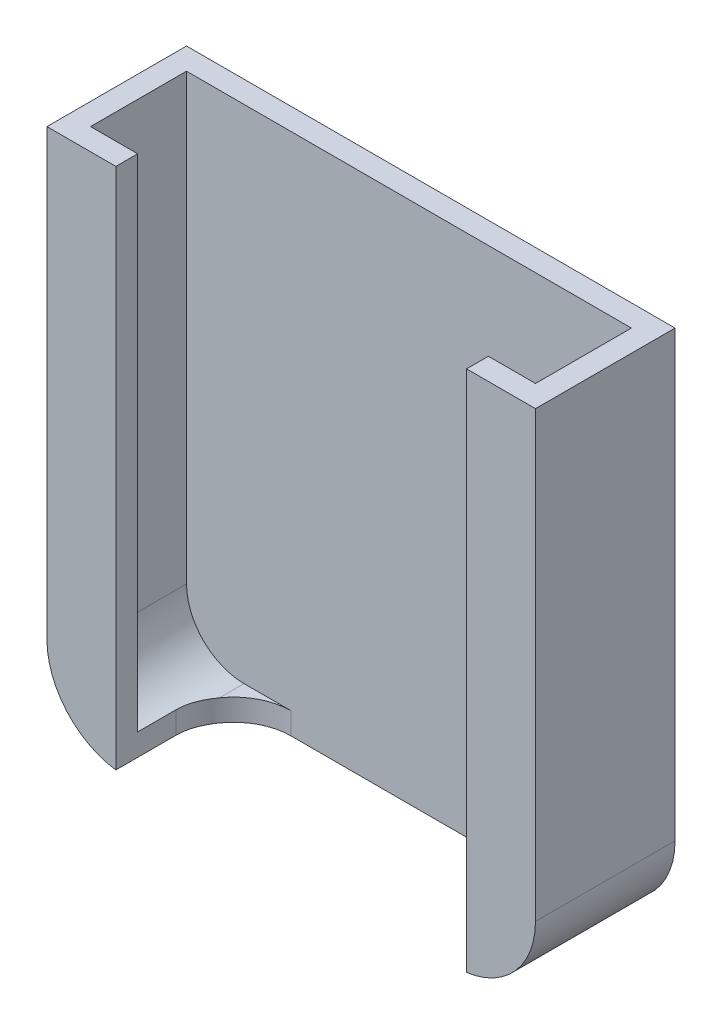
ISO-10303-21;
HEADER;
FILE_DESCRIPTION(('STEP AP214'),'2;1');
FILE_NAME('part.step','',(''),(''),'','','');
FILE_SCHEMA(('AUTOMOTIVE_DESIGN { 1 0 10303 214 1 1 1 1 }'));
ENDSEC;
DATA;
#1=APPLICATION_CONTEXT('core data for automotive mechanical design processes');
#2=APPLICATION_PROTOCOL_DEFINITION('international standard','automotive_design',2000,#1);
#3=PRODUCT_CONTEXT('',#1,'mechanical');
#4=PRODUCT('Part','Part','',(#3));
#5=PRODUCT_RELATED_PRODUCT_CATEGORY('part','',(#4));
#6=PRODUCT_DEFINITION_FORMATION('','',#4);
#7=PRODUCT_DEFINITION_CONTEXT('part definition',#1,'design');
#8=PRODUCT_DEFINITION('design','',#6,#7);
#9=PRODUCT_DEFINITION_SHAPE('','',#8);
#10=(LENGTH_UNIT() NAMED_UNIT(*) SI_UNIT(.MILLI.,.METRE.));
#11=(NAMED_UNIT(*) PLANE_ANGLE_UNIT() SI_UNIT($,.RADIAN.));
#12=(NAMED_UNIT(*) SI_UNIT($,.STERADIAN.) SOLID_ANGLE_UNIT());
#13=UNCERTAINTY_MEASURE_WITH_UNIT(LENGTH_MEASURE(1.E-05),#10,'distance_accuracy_value','');
#14=(GEOMETRIC_REPRESENTATION_CONTEXT(3) GLOBAL_UNCERTAINTY_ASSIGNED_CONTEXT((#13)) GLOBAL_UNIT_ASSIGNED_CONTEXT((#10,
#11,#12)) REPRESENTATION_CONTEXT('',''));
#15=CARTESIAN_POINT('',(0.,0.,0.));
#16=DIRECTION('',(0.,0.,1.));
#17=DIRECTION('',(1.,0.,0.));
#18=AXIS2_PLACEMENT_3D('',#15,#16,#17);
#19=CARTESIAN_POINT('',(0.,0.,10.16));
#20=DIRECTION('',(0.,1.,0.));
#21=DIRECTION('',(0.,0.,1.));
#22=AXIS2_PLACEMENT_3D('',#19,#20,#21);
#23=PLANE('',#22);
#24=DIRECTION('',(0.,0.,1.));
#25=VECTOR('',#24,1.);
#26=CARTESIAN_POINT('',(59.563,0.,-10.16));
#27=LINE('',#26,#25);
#28=CARTESIAN_POINT('',(59.563,0.,-10.16));
#29=VERTEX_POINT('',#28);
#30=CARTESIAN_POINT('',(59.563,0.,-3.42231115409661));
#31=VERTEX_POINT('',#30);
#32=EDGE_CURVE('E175',#29,#31,#27,.T.);
#33=ORIENTED_EDGE('',*,*,#32,.T.);
#34=CARTESIAN_POINT('',(52.705,0.,1.397));
#35=DIRECTION('',(0.,1.,0.));
#36=DIRECTION('',(0.,0.,1.));
#37=AXIS2_PLACEMENT_3D('',#34,#35,#36);
#38=CIRCLE('',#37,8.382);
#39=CARTESIAN_POINT('',(52.705,0.,-6.98500000000001));
#40=VERTEX_POINT('',#39);
#41=EDGE_CURVE('E231',#31,#40,#38,.T.);
#42=ORIENTED_EDGE('',*,*,#41,.T.);
#43=DIRECTION('',(-1.,0.,0.));
#44=VECTOR('',#43,1.);
#45=CARTESIAN_POINT('',(10.033,0.,-6.985));
#46=LINE('',#45,#44);
#47=CARTESIAN_POINT('',(18.415,0.,-6.985));
#48=VERTEX_POINT('',#47);
#49=EDGE_CURVE('E394',#40,#48,#46,.T.);
#50=ORIENTED_EDGE('',*,*,#49,.T.);
#51=CARTESIAN_POINT('',(18.415,0.,1.397));
#52=DIRECTION('',(0.,1.,0.));
#53=DIRECTION('',(0.,0.,1.));
#54=AXIS2_PLACEMENT_3D('',#51,#52,#53);
#55=CIRCLE('',#54,8.382);
#56=CARTESIAN_POINT('',(11.557,0.,-3.4223111540966));
#57=VERTEX_POINT('',#56);
#58=EDGE_CURVE('E226',#48,#57,#55,.T.);
#59=ORIENTED_EDGE('',*,*,#58,.T.);
#60=DIRECTION('',(0.,0.,1.));
#61=VECTOR('',#60,1.);
#62=CARTESIAN_POINT('',(11.557,0.,-10.16));
#63=LINE('',#62,#61);
#64=CARTESIAN_POINT('',(11.557,0.,-10.16));
#65=VERTEX_POINT('',#64);
#66=EDGE_CURVE('E63',#65,#57,#63,.T.);
#67=ORIENTED_EDGE('',*,*,#66,.F.);
#68=DIRECTION('',(1.,0.,0.));
#69=VECTOR('',#68,1.);
#70=CARTESIAN_POINT('',(0.,0.,-10.16));
#71=LINE('',#70,#69);
#72=EDGE_CURVE('E190',#65,#29,#71,.T.);
#73=ORIENTED_EDGE('',*,*,#72,.T.);
#74=EDGE_LOOP('',(#33,#42,#50,#59,#67,#73));
#75=FACE_BOUND('',#74,.T.);
#76=ADVANCED_FACE('F35',(#75),#23,.F.);
#77=CARTESIAN_POINT('',(0.,0.,10.16));
#78=DIRECTION('',(1.,0.,0.));
#79=DIRECTION('',(0.,1.,0.));
#80=AXIS2_PLACEMENT_3D('',#77,#78,#79);
#81=PLANE('',#80);
#82=DIRECTION('',(0.,0.,1.));
#83=VECTOR('',#82,1.);
#84=CARTESIAN_POINT('',(0.,11.557,-10.16));
#85=LINE('',#84,#83);
#86=CARTESIAN_POINT('',(0.,11.557,-10.16));
#87=VERTEX_POINT('',#86);
#88=CARTESIAN_POINT('',(0.,11.557,10.16));
#89=VERTEX_POINT('',#88);
#90=EDGE_CURVE('E405',#87,#89,#85,.T.);
#91=ORIENTED_EDGE('',*,*,#90,.T.);
#92=DIRECTION('',(0.,-1.,0.));
#93=VECTOR('',#92,1.);
#94=CARTESIAN_POINT('',(0.,0.,10.16));
#95=LINE('',#94,#93);
#96=CARTESIAN_POINT('',(0.,76.2,10.16));
#97=VERTEX_POINT('',#96);
#98=EDGE_CURVE('E206',#97,#89,#95,.T.);
#99=ORIENTED_EDGE('',*,*,#98,.F.);
#100=DIRECTION('',(0.,0.,-1.));
#101=VECTOR('',#100,1.);
#102=CARTESIAN_POINT('',(0.,76.2,10.16));
#103=LINE('',#102,#101);
#104=CARTESIAN_POINT('',(0.,76.2,-10.16));
#105=VERTEX_POINT('',#104);
#106=EDGE_CURVE('E207',#97,#105,#103,.T.);
#107=ORIENTED_EDGE('',*,*,#106,.T.);
#108=DIRECTION('',(0.,-1.,0.));
#109=VECTOR('',#108,1.);
#110=CARTESIAN_POINT('',(0.,0.,-10.16));
#111=LINE('',#110,#109);
#112=EDGE_CURVE('E196',#105,#87,#111,.T.);
#113=ORIENTED_EDGE('',*,*,#112,.T.);
#114=EDGE_LOOP('',(#91,#99,#107,#113));
#115=FACE_BOUND('',#114,.T.);
#116=ADVANCED_FACE('F281',(#115),#81,.F.);
#117=CARTESIAN_POINT('',(0.,0.,10.16));
#118=DIRECTION('',(0.,0.,-1.));
#119=DIRECTION('',(-1.,0.,0.));
#120=AXIS2_PLACEMENT_3D('',#117,#118,#119);
#121=PLANE('',#120);
#122=ORIENTED_EDGE('',*,*,#98,.T.);
#123=CARTESIAN_POINT('',(11.557,11.557,10.16));
#124=DIRECTION('',(0.,0.,-1.));
#125=DIRECTION('',(1.,0.,0.));
#126=AXIS2_PLACEMENT_3D('',#123,#124,#125);
#127=CIRCLE('',#126,11.557);
#128=CARTESIAN_POINT('',(10.033,0.10092418844918,10.16));
#129=VERTEX_POINT('',#128);
#130=EDGE_CURVE('E410',#129,#89,#127,.T.);
#131=ORIENTED_EDGE('',*,*,#130,.F.);
#132=DIRECTION('',(0.,1.,0.));
#133=VECTOR('',#132,1.);
#134=CARTESIAN_POINT('',(10.033,0.,10.16));
#135=LINE('',#134,#133);
#136=CARTESIAN_POINT('',(10.033,76.2,10.16));
#137=VERTEX_POINT('',#136);
#138=EDGE_CURVE('E392',#129,#137,#135,.T.);
#139=ORIENTED_EDGE('',*,*,#138,.T.);
#140=DIRECTION('',(-1.,0.,0.));
#141=VECTOR('',#140,1.);
#142=CARTESIAN_POINT('',(0.,76.2,10.16));
#143=LINE('',#142,#141);
#144=EDGE_CURVE('E350',#137,#97,#143,.T.);
#145=ORIENTED_EDGE('',*,*,#144,.T.);
#146=EDGE_LOOP('',(#122,#131,#139,#145));
#147=FACE_BOUND('',#146,.T.);
#148=ADVANCED_FACE('F286',(#147),#121,.F.);
#149=CARTESIAN_POINT('',(3.17499999999997,-66.2594431005876,6.985));
#150=DIRECTION('',(0.,0.,1.));
#151=DIRECTION('',(1.,0.,0.));
#152=AXIS2_PLACEMENT_3D('',#149,#150,#151);
#153=PLANE('',#152);
#154=DIRECTION('',(0.,-1.,0.));
#155=VECTOR('',#154,1.);
#156=CARTESIAN_POINT('',(10.033,-66.2594431005876,6.985));
#157=LINE('',#156,#155);
#158=CARTESIAN_POINT('',(10.033,76.2,6.985));
#159=VERTEX_POINT('',#158);
#160=CARTESIAN_POINT('',(10.033,3.31470978428932,6.985));
#161=VERTEX_POINT('',#160);
#162=EDGE_CURVE('E384',#159,#161,#157,.T.);
#163=ORIENTED_EDGE('',*,*,#162,.T.);
#164=CARTESIAN_POINT('',(11.557,11.557,6.985));
#165=DIRECTION('',(0.,0.,1.));
#166=DIRECTION('',(1.,0.,0.));
#167=AXIS2_PLACEMENT_3D('',#164,#165,#166);
#168=CIRCLE('',#167,8.382);
#169=CARTESIAN_POINT('',(3.17499999999997,11.557,6.985));
#170=VERTEX_POINT('',#169);
#171=EDGE_CURVE('E249',#161,#170,#168,.F.);
#172=ORIENTED_EDGE('',*,*,#171,.T.);
#173=DIRECTION('',(0.,1.,0.));
#174=VECTOR('',#173,1.);
#175=CARTESIAN_POINT('',(3.17499999999997,-66.2594431005876,6.985));
#176=LINE('',#175,#174);
#177=CARTESIAN_POINT('',(3.17499999999997,76.2,6.985));
#178=VERTEX_POINT('',#177);
#179=EDGE_CURVE('E363',#170,#178,#176,.T.);
#180=ORIENTED_EDGE('',*,*,#179,.T.);
#181=DIRECTION('',(1.,0.,0.));
#182=VECTOR('',#181,1.);
#183=CARTESIAN_POINT('',(3.17499999999997,76.2,6.985));
#184=LINE('',#183,#182);
#185=EDGE_CURVE('E378',#178,#159,#184,.T.);
#186=ORIENTED_EDGE('',*,*,#185,.T.);
#187=EDGE_LOOP('',(#163,#172,#180,#186));
#188=FACE_BOUND('',#187,.T.);
#189=ADVANCED_FACE('F331',(#188),#153,.F.);
#190=CARTESIAN_POINT('',(0.,3.175,10.16));
#191=DIRECTION('',(0.,1.,0.));
#192=DIRECTION('',(0.,0.,1.));
#193=AXIS2_PLACEMENT_3D('',#190,#191,#192);
#194=PLANE('',#193);
#195=DIRECTION('',(1.,0.,0.));
#196=VECTOR('',#195,1.);
#197=CARTESIAN_POINT('',(3.17499999999997,3.175,-6.985));
#198=LINE('',#197,#196);
#199=CARTESIAN_POINT('',(11.557,3.175,-6.985));
#200=VERTEX_POINT('',#199);
#201=CARTESIAN_POINT('',(18.415,3.175,-6.985));
#202=VERTEX_POINT('',#201);
#203=EDGE_CURVE('E201',#200,#202,#198,.T.);
#204=ORIENTED_EDGE('',*,*,#203,.F.);
#205=DIRECTION('',(0.,0.,-1.));
#206=VECTOR('',#205,1.);
#207=CARTESIAN_POINT('',(11.557,3.175,10.16));
#208=LINE('',#207,#206);
#209=CARTESIAN_POINT('',(11.557,3.175,-3.4223111540966));
#210=VERTEX_POINT('',#209);
#211=EDGE_CURVE('E247',#200,#210,#208,.F.);
#212=ORIENTED_EDGE('',*,*,#211,.T.);
#213=CARTESIAN_POINT('',(18.415,3.175,1.397));
#214=DIRECTION('',(0.,1.,0.));
#215=DIRECTION('',(0.,0.,1.));
#216=AXIS2_PLACEMENT_3D('',#213,#214,#215);
#217=CIRCLE('',#216,8.382);
#218=EDGE_CURVE('E224',#210,#202,#217,.F.);
#219=ORIENTED_EDGE('',*,*,#218,.T.);
#220=EDGE_LOOP('',(#204,#212,#219));
#221=FACE_BOUND('',#220,.T.);
#222=ADVANCED_FACE('F318',(#221),#194,.T.);
#223=CARTESIAN_POINT('',(71.12,0.,10.16));
#224=DIRECTION('',(-1.,0.,0.));
#225=DIRECTION('',(0.,-1.,0.));
#226=AXIS2_PLACEMENT_3D('',#223,#224,#225);
#227=PLANE('',#226);
#228=DIRECTION('',(0.,1.,0.));
#229=VECTOR('',#228,1.);
#230=CARTESIAN_POINT('',(71.12,0.,10.16));
#231=LINE('',#230,#229);
#232=CARTESIAN_POINT('',(71.12,11.557,10.16));
#233=VERTEX_POINT('',#232);
#234=CARTESIAN_POINT('',(71.12,76.2,10.16));
#235=VERTEX_POINT('',#234);
#236=EDGE_CURVE('E358',#233,#235,#231,.T.);
#237=ORIENTED_EDGE('',*,*,#236,.F.);
#238=DIRECTION('',(0.,0.,1.));
#239=VECTOR('',#238,1.);
#240=CARTESIAN_POINT('',(71.12,11.557,-10.16));
#241=LINE('',#240,#239);
#242=CARTESIAN_POINT('',(71.12,11.557,-10.16));
#243=VERTEX_POINT('',#242);
#244=EDGE_CURVE('E183',#243,#233,#241,.T.);
#245=ORIENTED_EDGE('',*,*,#244,.F.);
#246=DIRECTION('',(0.,1.,0.));
#247=VECTOR('',#246,1.);
#248=CARTESIAN_POINT('',(71.12,0.,-10.16));
#249=LINE('',#248,#247);
#250=CARTESIAN_POINT('',(71.12,76.2,-10.16));
#251=VERTEX_POINT('',#250);
#252=EDGE_CURVE('E192',#243,#251,#249,.T.);
#253=ORIENTED_EDGE('',*,*,#252,.T.);
#254=DIRECTION('',(0.,0.,-1.));
#255=VECTOR('',#254,1.);
#256=CARTESIAN_POINT('',(71.12,76.2,10.16));
#257=LINE('',#256,#255);
#258=EDGE_CURVE('E210',#235,#251,#257,.T.);
#259=ORIENTED_EDGE('',*,*,#258,.F.);
#260=EDGE_LOOP('',(#237,#245,#253,#259));
#261=FACE_BOUND('',#260,.T.);
#262=ADVANCED_FACE('F290',(#261),#227,.F.);
#263=CARTESIAN_POINT('',(0.,76.2,10.16));
#264=DIRECTION('',(0.,-1.,0.));
#265=DIRECTION('',(0.,0.,-1.));
#266=AXIS2_PLACEMENT_3D('',#263,#264,#265);
#267=PLANE('',#266);
#268=ORIENTED_EDGE('',*,*,#144,.F.);
#269=DIRECTION('',(0.,0.,1.));
#270=VECTOR('',#269,1.);
#271=CARTESIAN_POINT('',(10.033,76.2,10.16));
#272=LINE('',#271,#270);
#273=EDGE_CURVE('E353',#159,#137,#272,.T.);
#274=ORIENTED_EDGE('',*,*,#273,.F.);
#275=ORIENTED_EDGE('',*,*,#185,.F.);
#276=DIRECTION('',(0.,0.,1.));
#277=VECTOR('',#276,1.);
#278=CARTESIAN_POINT('',(3.17499999999997,76.2,6.985));
#279=LINE('',#278,#277);
#280=CARTESIAN_POINT('',(3.17499999999997,76.2,-6.985));
#281=VERTEX_POINT('',#280);
#282=EDGE_CURVE('E381',#281,#178,#279,.T.);
#283=ORIENTED_EDGE('',*,*,#282,.F.);
#284=DIRECTION('',(-1.,0.,0.));
#285=VECTOR('',#284,1.);
#286=CARTESIAN_POINT('',(3.17499999999997,76.2,-6.985));
#287=LINE('',#286,#285);
#288=CARTESIAN_POINT('',(67.945,76.2,-6.985));
#289=VERTEX_POINT('',#288);
#290=EDGE_CURVE('E366',#289,#281,#287,.T.);
#291=ORIENTED_EDGE('',*,*,#290,.F.);
#292=DIRECTION('',(0.,0.,-1.));
#293=VECTOR('',#292,1.);
#294=CARTESIAN_POINT('',(67.945,76.2,-6.985));
#295=LINE('',#294,#293);
#296=CARTESIAN_POINT('',(67.945,76.2,6.985));
#297=VERTEX_POINT('',#296);
#298=EDGE_CURVE('E375',#297,#289,#295,.T.);
#299=ORIENTED_EDGE('',*,*,#298,.F.);
#300=CARTESIAN_POINT('',(61.087,76.2,6.985));
#301=VERTEX_POINT('',#300);
#302=EDGE_CURVE('E380',#301,#297,#184,.T.);
#303=ORIENTED_EDGE('',*,*,#302,.F.);
#304=DIRECTION('',(0.,0.,-1.));
#305=VECTOR('',#304,1.);
#306=CARTESIAN_POINT('',(61.087,76.2,10.16));
#307=LINE('',#306,#305);
#308=CARTESIAN_POINT('',(61.087,76.2,10.16));
#309=VERTEX_POINT('',#308);
#310=EDGE_CURVE('E396',#309,#301,#307,.T.);
#311=ORIENTED_EDGE('',*,*,#310,.F.);
#312=EDGE_CURVE('E211',#235,#309,#143,.T.);
#313=ORIENTED_EDGE('',*,*,#312,.F.);
#314=ORIENTED_EDGE('',*,*,#258,.T.);
#315=DIRECTION('',(-1.,0.,0.));
#316=VECTOR('',#315,1.);
#317=CARTESIAN_POINT('',(0.,76.2,-10.16));
#318=LINE('',#317,#316);
#319=EDGE_CURVE('E198',#251,#105,#318,.T.);
#320=ORIENTED_EDGE('',*,*,#319,.T.);
#321=ORIENTED_EDGE('',*,*,#106,.F.);
#322=EDGE_LOOP('',(#268,#274,#275,#283,#291,#299,#303,#311,#313,#314,#320,#321));
#323=FACE_BOUND('',#322,.T.);
#324=ADVANCED_FACE('F338',(#323),#267,.F.);
#325=DIRECTION('',(0.,1.,0.));
#326=VECTOR('',#325,1.);
#327=CARTESIAN_POINT('',(61.087,0.,10.16));
#328=LINE('',#327,#326);
#329=CARTESIAN_POINT('',(61.087,0.100924188449163,10.16));
#330=VERTEX_POINT('',#329);
#331=EDGE_CURVE('E391',#330,#309,#328,.T.);
#332=ORIENTED_EDGE('',*,*,#331,.F.);
#333=CARTESIAN_POINT('',(59.563,11.557,10.16));
#334=DIRECTION('',(0.,0.,-1.));
#335=DIRECTION('',(1.,0.,0.));
#336=AXIS2_PLACEMENT_3D('',#333,#334,#335);
#337=CIRCLE('',#336,11.557);
#338=EDGE_CURVE('E193',#233,#330,#337,.T.);
#339=ORIENTED_EDGE('',*,*,#338,.F.);
#340=ORIENTED_EDGE('',*,*,#236,.T.);
#341=ORIENTED_EDGE('',*,*,#312,.T.);
#342=EDGE_LOOP('',(#332,#339,#340,#341));
#343=FACE_BOUND('',#342,.T.);
#344=ADVANCED_FACE('F335',(#343),#121,.F.);
#345=CARTESIAN_POINT('',(0.,0.,-10.16));
#346=DIRECTION('',(0.,0.,-1.));
#347=DIRECTION('',(-1.,0.,0.));
#348=AXIS2_PLACEMENT_3D('',#345,#346,#347);
#349=PLANE('',#348);
#350=CARTESIAN_POINT('',(59.563,11.557,-10.16));
#351=DIRECTION('',(0.,0.,-1.));
#352=DIRECTION('',(1.,0.,0.));
#353=AXIS2_PLACEMENT_3D('',#350,#351,#352);
#354=CIRCLE('',#353,11.557);
#355=EDGE_CURVE('E178',#243,#29,#354,.T.);
#356=ORIENTED_EDGE('',*,*,#355,.T.);
#357=ORIENTED_EDGE('',*,*,#72,.F.);
#358=CARTESIAN_POINT('',(11.557,11.557,-10.16));
#359=DIRECTION('',(0.,0.,-1.));
#360=DIRECTION('',(1.,0.,0.));
#361=AXIS2_PLACEMENT_3D('',#358,#359,#360);
#362=CIRCLE('',#361,11.557);
#363=EDGE_CURVE('E408',#65,#87,#362,.T.);
#364=ORIENTED_EDGE('',*,*,#363,.T.);
#365=ORIENTED_EDGE('',*,*,#112,.F.);
#366=ORIENTED_EDGE('',*,*,#319,.F.);
#367=ORIENTED_EDGE('',*,*,#252,.F.);
#368=EDGE_LOOP('',(#356,#357,#364,#365,#366,#367));
#369=FACE_BOUND('',#368,.T.);
#370=ADVANCED_FACE('F188',(#369),#349,.T.);
#371=CARTESIAN_POINT('',(3.17499999999997,-66.2594431005876,6.985));
#372=DIRECTION('',(-1.,0.,0.));
#373=DIRECTION('',(0.,0.,1.));
#374=AXIS2_PLACEMENT_3D('',#371,#372,#373);
#375=PLANE('',#374);
#376=ORIENTED_EDGE('',*,*,#179,.F.);
#377=DIRECTION('',(0.,0.,-1.));
#378=VECTOR('',#377,1.);
#379=CARTESIAN_POINT('',(3.17499999999997,11.557,6.985));
#380=LINE('',#379,#378);
#381=CARTESIAN_POINT('',(3.17499999999997,11.557,-6.985));
#382=VERTEX_POINT('',#381);
#383=EDGE_CURVE('E244',#170,#382,#380,.T.);
#384=ORIENTED_EDGE('',*,*,#383,.T.);
#385=DIRECTION('',(0.,1.,0.));
#386=VECTOR('',#385,1.);
#387=CARTESIAN_POINT('',(3.17499999999997,-66.2594431005876,-6.985));
#388=LINE('',#387,#386);
#389=EDGE_CURVE('E370',#382,#281,#388,.T.);
#390=ORIENTED_EDGE('',*,*,#389,.T.);
#391=ORIENTED_EDGE('',*,*,#282,.T.);
#392=EDGE_LOOP('',(#376,#384,#390,#391));
#393=FACE_BOUND('',#392,.T.);
#394=ADVANCED_FACE('F323',(#393),#375,.F.);
#395=CARTESIAN_POINT('',(3.17499999999997,-66.2594431005876,-6.985));
#396=DIRECTION('',(0.,0.,-1.));
#397=DIRECTION('',(-1.,0.,0.));
#398=AXIS2_PLACEMENT_3D('',#395,#396,#397);
#399=PLANE('',#398);
#400=CARTESIAN_POINT('',(52.705,3.175,-6.985));
#401=VERTEX_POINT('',#400);
#402=CARTESIAN_POINT('',(59.563,3.175,-6.985));
#403=VERTEX_POINT('',#402);
#404=EDGE_CURVE('E372',#401,#403,#198,.T.);
#405=ORIENTED_EDGE('',*,*,#404,.T.);
#406=CARTESIAN_POINT('',(59.563,11.557,-6.985));
#407=DIRECTION('',(0.,0.,-1.));
#408=DIRECTION('',(-1.,0.,0.));
#409=AXIS2_PLACEMENT_3D('',#406,#407,#408);
#410=CIRCLE('',#409,8.382);
#411=CARTESIAN_POINT('',(67.945,11.557,-6.985));
#412=VERTEX_POINT('',#411);
#413=EDGE_CURVE('E242',#403,#412,#410,.F.);
#414=ORIENTED_EDGE('',*,*,#413,.T.);
#415=DIRECTION('',(0.,1.,0.));
#416=VECTOR('',#415,1.);
#417=CARTESIAN_POINT('',(67.945,-66.2594431005876,-6.985));
#418=LINE('',#417,#416);
#419=EDGE_CURVE('E368',#412,#289,#418,.T.);
#420=ORIENTED_EDGE('',*,*,#419,.T.);
#421=ORIENTED_EDGE('',*,*,#290,.T.);
#422=ORIENTED_EDGE('',*,*,#389,.F.);
#423=CARTESIAN_POINT('',(11.557,11.557,-6.985));
#424=DIRECTION('',(0.,0.,-1.));
#425=DIRECTION('',(-1.,0.,0.));
#426=AXIS2_PLACEMENT_3D('',#423,#424,#425);
#427=CIRCLE('',#426,8.382);
#428=EDGE_CURVE('E240',#382,#200,#427,.F.);
#429=ORIENTED_EDGE('',*,*,#428,.T.);
#430=ORIENTED_EDGE('',*,*,#203,.T.);
#431=DIRECTION('',(0.,1.,0.));
#432=VECTOR('',#431,1.);
#433=CARTESIAN_POINT('',(18.415,0.,-6.985));
#434=LINE('',#433,#432);
#435=EDGE_CURVE('E219',#202,#48,#434,.F.);
#436=ORIENTED_EDGE('',*,*,#435,.T.);
#437=ORIENTED_EDGE('',*,*,#49,.F.);
#438=DIRECTION('',(0.,1.,0.));
#439=VECTOR('',#438,1.);
#440=CARTESIAN_POINT('',(52.705,3.175,-6.985));
#441=LINE('',#440,#439);
#442=EDGE_CURVE('E216',#40,#401,#441,.T.);
#443=ORIENTED_EDGE('',*,*,#442,.T.);
#444=EDGE_LOOP('',(#405,#414,#420,#421,#422,#429,#430,#436,#437,#443));
#445=FACE_BOUND('',#444,.T.);
#446=ADVANCED_FACE('F319',(#445),#399,.F.);
#447=CARTESIAN_POINT('',(67.945,-66.2594431005876,-6.985));
#448=DIRECTION('',(1.,0.,0.));
#449=DIRECTION('',(0.,0.,-1.));
#450=AXIS2_PLACEMENT_3D('',#447,#448,#449);
#451=PLANE('',#450);
#452=ORIENTED_EDGE('',*,*,#419,.F.);
#453=DIRECTION('',(0.,0.,1.));
#454=VECTOR('',#453,1.);
#455=CARTESIAN_POINT('',(67.945,11.557,-6.985));
#456=LINE('',#455,#454);
#457=CARTESIAN_POINT('',(67.945,11.557,6.985));
#458=VERTEX_POINT('',#457);
#459=EDGE_CURVE('E233',#412,#458,#456,.T.);
#460=ORIENTED_EDGE('',*,*,#459,.T.);
#461=DIRECTION('',(0.,1.,0.));
#462=VECTOR('',#461,1.);
#463=CARTESIAN_POINT('',(67.945,-66.2594431005876,6.985));
#464=LINE('',#463,#462);
#465=EDGE_CURVE('E365',#458,#297,#464,.T.);
#466=ORIENTED_EDGE('',*,*,#465,.T.);
#467=ORIENTED_EDGE('',*,*,#298,.T.);
#468=EDGE_LOOP('',(#452,#460,#466,#467));
#469=FACE_BOUND('',#468,.T.);
#470=ADVANCED_FACE('F322',(#469),#451,.F.);
#471=ORIENTED_EDGE('',*,*,#465,.F.);
#472=CARTESIAN_POINT('',(59.563,11.557,6.985));
#473=DIRECTION('',(0.,0.,1.));
#474=DIRECTION('',(1.,0.,0.));
#475=AXIS2_PLACEMENT_3D('',#472,#473,#474);
#476=CIRCLE('',#475,8.382);
#477=CARTESIAN_POINT('',(61.087,3.31470978428932,6.985));
#478=VERTEX_POINT('',#477);
#479=EDGE_CURVE('E236',#458,#478,#476,.F.);
#480=ORIENTED_EDGE('',*,*,#479,.T.);
#481=DIRECTION('',(0.,1.,0.));
#482=VECTOR('',#481,1.);
#483=CARTESIAN_POINT('',(61.087,-66.2594431005876,6.985));
#484=LINE('',#483,#482);
#485=EDGE_CURVE('E389',#478,#301,#484,.T.);
#486=ORIENTED_EDGE('',*,*,#485,.T.);
#487=ORIENTED_EDGE('',*,*,#302,.T.);
#488=EDGE_LOOP('',(#471,#480,#486,#487));
#489=FACE_BOUND('',#488,.T.);
#490=ADVANCED_FACE('F316',(#489),#153,.F.);
#491=CARTESIAN_POINT('',(52.705,3.175,1.397));
#492=DIRECTION('',(0.,1.,0.));
#493=DIRECTION('',(0.,0.,1.));
#494=AXIS2_PLACEMENT_3D('',#491,#492,#493);
#495=CIRCLE('',#494,8.382);
#496=CARTESIAN_POINT('',(59.563,3.175,-3.42231115409661));
#497=VERTEX_POINT('',#496);
#498=EDGE_CURVE('E228',#401,#497,#495,.F.);
#499=ORIENTED_EDGE('',*,*,#498,.T.);
#500=DIRECTION('',(0.,0.,1.));
#501=VECTOR('',#500,1.);
#502=CARTESIAN_POINT('',(59.563,3.175,10.16));
#503=LINE('',#502,#501);
#504=EDGE_CURVE('E238',#497,#403,#503,.F.);
#505=ORIENTED_EDGE('',*,*,#504,.T.);
#506=ORIENTED_EDGE('',*,*,#404,.F.);
#507=EDGE_LOOP('',(#499,#505,#506));
#508=FACE_BOUND('',#507,.T.);
#509=ADVANCED_FACE('F312',(#508),#194,.T.);
#510=CARTESIAN_POINT('',(10.033,0.,10.16));
#511=DIRECTION('',(-1.,0.,0.));
#512=DIRECTION('',(0.,0.,1.));
#513=AXIS2_PLACEMENT_3D('',#510,#511,#512);
#514=PLANE('',#513);
#515=ORIENTED_EDGE('',*,*,#138,.F.);
#516=DIRECTION('',(0.,0.,1.));
#517=VECTOR('',#516,1.);
#518=CARTESIAN_POINT('',(10.033,0.100924188449182,-10.16));
#519=LINE('',#518,#517);
#520=CARTESIAN_POINT('',(10.033,0.10092418844918,1.397));
#521=VERTEX_POINT('',#520);
#522=EDGE_CURVE('E400',#129,#521,#519,.F.);
#523=ORIENTED_EDGE('',*,*,#522,.T.);
#524=DIRECTION('',(0.,1.,0.));
#525=VECTOR('',#524,1.);
#526=CARTESIAN_POINT('',(10.033,3.175,1.397));
#527=LINE('',#526,#525);
#528=CARTESIAN_POINT('',(10.033,3.31470978428932,1.397));
#529=VERTEX_POINT('',#528);
#530=EDGE_CURVE('E214',#521,#529,#527,.T.);
#531=ORIENTED_EDGE('',*,*,#530,.T.);
#532=DIRECTION('',(0.,0.,-1.));
#533=VECTOR('',#532,1.);
#534=CARTESIAN_POINT('',(10.033,3.31470978428932,1.397));
#535=LINE('',#534,#533);
#536=EDGE_CURVE('E301',#529,#161,#535,.F.);
#537=ORIENTED_EDGE('',*,*,#536,.T.);
#538=ORIENTED_EDGE('',*,*,#162,.F.);
#539=ORIENTED_EDGE('',*,*,#273,.T.);
#540=EDGE_LOOP('',(#515,#523,#531,#537,#538,#539));
#541=FACE_BOUND('',#540,.T.);
#542=ADVANCED_FACE('F308',(#541),#514,.F.);
#543=CARTESIAN_POINT('',(61.087,0.,10.16));
#544=DIRECTION('',(1.,0.,0.));
#545=DIRECTION('',(0.,0.,-1.));
#546=AXIS2_PLACEMENT_3D('',#543,#544,#545);
#547=PLANE('',#546);
#548=DIRECTION('',(0.,1.,0.));
#549=VECTOR('',#548,1.);
#550=CARTESIAN_POINT('',(61.087,0.,1.397));
#551=LINE('',#550,#549);
#552=CARTESIAN_POINT('',(61.087,3.31470978428932,1.397));
#553=VERTEX_POINT('',#552);
#554=CARTESIAN_POINT('',(61.087,0.100924188449163,1.397));
#555=VERTEX_POINT('',#554);
#556=EDGE_CURVE('E221',#553,#555,#551,.F.);
#557=ORIENTED_EDGE('',*,*,#556,.T.);
#558=DIRECTION('',(0.,0.,1.));
#559=VECTOR('',#558,1.);
#560=CARTESIAN_POINT('',(61.087,0.100924188449165,-10.16));
#561=LINE('',#560,#559);
#562=EDGE_CURVE('E56',#555,#330,#561,.T.);
#563=ORIENTED_EDGE('',*,*,#562,.T.);
#564=ORIENTED_EDGE('',*,*,#331,.T.);
#565=ORIENTED_EDGE('',*,*,#310,.T.);
#566=ORIENTED_EDGE('',*,*,#485,.F.);
#567=DIRECTION('',(0.,0.,1.));
#568=VECTOR('',#567,1.);
#569=CARTESIAN_POINT('',(61.087,3.31470978428932,6.985));
#570=LINE('',#569,#568);
#571=EDGE_CURVE('E251',#478,#553,#570,.F.);
#572=ORIENTED_EDGE('',*,*,#571,.T.);
#573=EDGE_LOOP('',(#557,#563,#564,#565,#566,#572));
#574=FACE_BOUND('',#573,.T.);
#575=ADVANCED_FACE('F294',(#574),#547,.F.);
#576=CARTESIAN_POINT('',(18.415,0.,1.397));
#577=DIRECTION('',(0.,-1.,0.));
#578=DIRECTION('',(0.,0.,-1.));
#579=AXIS2_PLACEMENT_3D('',#576,#577,#578);
#580=CYLINDRICAL_SURFACE('',#579,8.382);
#581=ORIENTED_EDGE('',*,*,#530,.F.);
#582=CARTESIAN_POINT('',(10.033,0.10092418844918,1.397));
#583=CARTESIAN_POINT('',(10.0330001216002,0.100926891769128,1.27781716958431));
#584=CARTESIAN_POINT('',(10.0355424176954,0.100585614265902,1.15864982102148));
#585=CARTESIAN_POINT('',(10.0457042230159,0.0992396665317981,0.920537679390941));
#586=CARTESIAN_POINT('',(10.0533236410662,0.0982350082139283,0.80159288236512));
#587=CARTESIAN_POINT('',(10.0837819447924,0.0942634557610099,0.445432522595272));
#588=CARTESIAN_POINT('',(10.1142208878112,0.0903389608833738,0.208831330691911));
#589=CARTESIAN_POINT('',(10.1941123595587,0.0805742377931407,-0.254947171099258));
#590=CARTESIAN_POINT('',(10.2430691985292,0.0747844920747429,-0.482212045978354));
#591=CARTESIAN_POINT('',(10.3596714428242,0.0620404757614991,-0.931845666758199));
#592=CARTESIAN_POINT('',(10.4273140081907,0.0550863821937644,-1.15421515114619));
#593=CARTESIAN_POINT('',(10.5670345353444,0.0423050103386449,-1.55320004000974));
#594=CARTESIAN_POINT('',(10.6361384129774,0.0364994583879133,-1.73086531631127));
#595=CARTESIAN_POINT('',(10.7862971998082,0.0254809787598834,-2.08109075787499));
#596=CARTESIAN_POINT('',(10.8673516375383,0.020268027717945,-2.25365112421128));
#597=CARTESIAN_POINT('',(11.0428817355593,0.0110989808812452,-2.59644956344424));
#598=CARTESIAN_POINT('',(11.1376041347307,0.00717167205607876,-2.76656215831424));
#599=CARTESIAN_POINT('',(11.3386902087527,0.00162702019785621,-3.09985526550659));
#600=CARTESIAN_POINT('',(11.4450567156999,1.02404848771378E-05,-3.26303407792789));
#601=CARTESIAN_POINT('',(11.557,0.,-3.4223111540966));
#602=B_SPLINE_CURVE_WITH_KNOTS('',3,(#582,#583,#584,#585,#586,#587,#588,#589,#590,#591,#592,
#593,#594,#595,#596,#597,#598,#599,#600,#601),.UNSPECIFIED.,.F.,.F.,(4,2,2,2,2,2,2,2,2,4),(0.,
0.357490042474049,0.714973665308341,1.42976252578464,2.12663552232626,2.82340266254982,
3.39513722266547,3.96684923302036,4.55060364014651,5.13450034563536),.UNSPECIFIED.);
#603=EDGE_CURVE('E49',#521,#57,#602,.T.);
#604=ORIENTED_EDGE('',*,*,#603,.T.);
#605=ORIENTED_EDGE('',*,*,#58,.F.);
#606=ORIENTED_EDGE('',*,*,#435,.F.);
#607=ORIENTED_EDGE('',*,*,#218,.F.);
#608=CARTESIAN_POINT('',(11.557,3.175,-3.4223111540966));
#609=CARTESIAN_POINT('',(11.4201706380643,3.17503475193489,-3.22764680998369));
#610=CARTESIAN_POINT('',(11.2917028457249,3.17835195050124,-3.02716753462913));
#611=CARTESIAN_POINT('',(11.0523166747494,3.1893402171039,-2.61613449760462));
#612=CARTESIAN_POINT('',(10.94139583245,3.19701067323013,-2.4055821556505));
#613=CARTESIAN_POINT('',(10.7404455942976,3.21427618772132,-1.98129671003755));
#614=CARTESIAN_POINT('',(10.6499616014961,3.22381809059751,-1.76777618591542));
#615=CARTESIAN_POINT('',(10.4869983719878,3.24316990289561,-1.3340011786149));
#616=CARTESIAN_POINT('',(10.4145168103213,3.25297977752797,-1.11374756912473));
#617=CARTESIAN_POINT('',(10.2991419187214,3.26975179948074,-0.707107658176294));
#618=CARTESIAN_POINT('',(10.2532881630663,3.27691155604305,-0.521562991350999));
#619=CARTESIAN_POINT('',(10.1743578475587,3.28972616933864,-0.147741732242475));
#620=CARTESIAN_POINT('',(10.1412795830204,3.29538122681869,0.0405344920769149));
#621=CARTESIAN_POINT('',(10.0875018732331,3.30476967121521,0.422960293094251));
#622=CARTESIAN_POINT('',(10.0670789956505,3.30845989159719,0.617149877225599));
#623=CARTESIAN_POINT('',(10.0398198567832,3.31344992420793,1.00655783476446));
#624=CARTESIAN_POINT('',(10.0329869249475,3.31474915065279,1.20177644853493));
#625=CARTESIAN_POINT('',(10.033,3.31470978428932,1.397));
#626=B_SPLINE_CURVE_WITH_KNOTS('',3,(#608,#609,#610,#611,#612,#613,#614,#615,#616,#617,#618,
#619,#620,#621,#622,#623,#624,#625),.UNSPECIFIED.,.F.,.F.,(4,2,2,2,2,2,2,2,4),(0.,
0.713520967732658,1.42694166513299,2.12245071277513,2.81786989076243,3.39121929980478,
3.96449217804505,4.54988807116165,5.13542736483504),.UNSPECIFIED.);
#627=EDGE_CURVE('E259',#210,#529,#626,.T.);
#628=ORIENTED_EDGE('',*,*,#627,.T.);
#629=EDGE_LOOP('',(#581,#604,#605,#606,#607,#628));
#630=FACE_BOUND('',#629,.T.);
#631=ADVANCED_FACE('F277',(#630),#580,.F.);
#632=CARTESIAN_POINT('',(52.705,-66.2594431005876,1.397));
#633=DIRECTION('',(0.,-1.,0.));
#634=DIRECTION('',(0.,0.,-1.));
#635=AXIS2_PLACEMENT_3D('',#632,#633,#634);
#636=CYLINDRICAL_SURFACE('',#635,8.382);
#637=ORIENTED_EDGE('',*,*,#41,.F.);
#638=CARTESIAN_POINT('',(59.563,0.,-3.42231115409661));
#639=CARTESIAN_POINT('',(59.7000223702688,2.47684491130002E-05,-3.22737237744299));
#640=CARTESIAN_POINT('',(59.8286730377486,0.00243838190259442,-3.02658276691352));
#641=CARTESIAN_POINT('',(60.0684017285889,0.0104265877248981,-2.61484020560105));
#642=CARTESIAN_POINT('',(60.1794804942256,0.0160010465269709,-2.40388768461329));
#643=CARTESIAN_POINT('',(60.380690006115,0.028535168517937,-1.97874547450376));
#644=CARTESIAN_POINT('',(60.4712766536532,0.0354565417167773,-1.76477001852518));
#645=CARTESIAN_POINT('',(60.634369257799,0.0494749127185589,-1.33006649045538));
#646=CARTESIAN_POINT('',(60.7068780408488,0.0565718828762568,-1.10933948002388));
#647=CARTESIAN_POINT('',(60.8220273923833,0.0686661808126888,-0.702558789218959));
#648=CARTESIAN_POINT('',(60.8676899830859,0.0738120772353291,-0.517358119157079));
#649=CARTESIAN_POINT('',(60.9462844523628,0.0830149818996997,-0.144263203005644));
#650=CARTESIAN_POINT('',(60.9792178290924,0.087072118265024,0.0436307234019774));
#651=CARTESIAN_POINT('',(61.0327542381561,0.0938041658661406,0.425238078171038));
#652=CARTESIAN_POINT('',(61.0530824299556,0.0964481049683222,0.618990644538696));
#653=CARTESIAN_POINT('',(61.0802128407898,0.100022117312855,1.00749434014216));
#654=CARTESIAN_POINT('',(61.0870123724981,0.10095185004341,1.2022456600687));
#655=CARTESIAN_POINT('',(61.087,0.100924188449163,1.397));
#656=B_SPLINE_CURVE_WITH_KNOTS('',3,(#638,#639,#640,#641,#642,#643,#644,#645,#646,#647,#648,
#649,#650,#651,#652,#653,#654,#655),.UNSPECIFIED.,.F.,.F.,(4,2,2,2,2,2,2,2,4),(0.,
0.714569659375951,1.42910912567878,2.12570961959884,2.82220113286937,3.39422163502125,
3.96617479314039,4.5501964963599,5.13433419778497),.UNSPECIFIED.);
#657=EDGE_CURVE('E12',#31,#555,#656,.T.);
#658=ORIENTED_EDGE('',*,*,#657,.T.);
#659=ORIENTED_EDGE('',*,*,#556,.F.);
#660=CARTESIAN_POINT('',(61.087,3.31470978428932,1.397));
#661=CARTESIAN_POINT('',(61.086999951074,3.31471360552115,1.27795622423954));
#662=CARTESIAN_POINT('',(61.084463506646,3.3142402901934,1.15892812664425));
#663=CARTESIAN_POINT('',(61.0743256214428,3.31237404363014,0.921097964431036));
#664=CARTESIAN_POINT('',(61.0667243061785,3.31098113518281,0.802295894285155));
#665=CARTESIAN_POINT('',(61.0363413231231,3.30547619290463,0.446591087139193));
#666=CARTESIAN_POINT('',(61.0059806065798,3.30003789821157,0.21030998239803));
#667=CARTESIAN_POINT('',(60.9263057510118,3.28651659984915,-0.25281902135462));
#668=CARTESIAN_POINT('',(60.8774850165142,3.27850319739935,-0.479755005596635));
#669=CARTESIAN_POINT('',(60.7612184118657,3.26087712330699,-0.928730097119809));
#670=CARTESIAN_POINT('',(60.6937747953313,3.25126464522978,-1.15076979340836));
#671=CARTESIAN_POINT('',(60.5542732117693,3.2335802089725,-1.54973722737956));
#672=CARTESIAN_POINT('',(60.4851419246255,3.22553653197032,-1.72769702652051));
#673=CARTESIAN_POINT('',(60.334884011057,3.21027495334213,-2.07851483839741));
#674=CARTESIAN_POINT('',(60.2537578900026,3.20305701694848,-2.25137306570655));
#675=CARTESIAN_POINT('',(60.0780236415889,3.19036312265616,-2.59479365316573));
#676=CARTESIAN_POINT('',(59.9831670847643,3.1849271497292,-2.76523053859602));
#677=CARTESIAN_POINT('',(59.7817453537058,3.17725244593583,-3.09918646021181));
#678=CARTESIAN_POINT('',(59.6751763381828,3.17501476739148,-3.26270320232581));
#679=CARTESIAN_POINT('',(59.563,3.175,-3.42231115409661));
#680=B_SPLINE_CURVE_WITH_KNOTS('',3,(#660,#661,#662,#663,#664,#665,#666,#667,#668,#669,#670,
#671,#672,#673,#674,#675,#676,#677,#678,#679),.UNSPECIFIED.,.F.,.F.,(4,2,2,2,2,2,2,2,2,4),(0.,
0.357072189592467,0.714135531016401,1.42802370834288,2.1240439847689,2.81998007036252,
3.39280880051047,3.96561340292291,4.5505085843434,5.13559616722814),.UNSPECIFIED.);
#681=EDGE_CURVE('E254',#553,#497,#680,.T.);
#682=ORIENTED_EDGE('',*,*,#681,.T.);
#683=ORIENTED_EDGE('',*,*,#498,.F.);
#684=ORIENTED_EDGE('',*,*,#442,.F.);
#685=EDGE_LOOP('',(#637,#658,#659,#682,#683,#684));
#686=FACE_BOUND('',#685,.T.);
#687=ADVANCED_FACE('F265',(#686),#636,.F.);
#688=CARTESIAN_POINT('',(59.563,11.557,-6.985));
#689=DIRECTION('',(0.,0.,1.));
#690=DIRECTION('',(1.,0.,0.));
#691=AXIS2_PLACEMENT_3D('',#688,#689,#690);
#692=CYLINDRICAL_SURFACE('',#691,8.382);
#693=ORIENTED_EDGE('',*,*,#413,.F.);
#694=ORIENTED_EDGE('',*,*,#504,.F.);
#695=ORIENTED_EDGE('',*,*,#681,.F.);
#696=ORIENTED_EDGE('',*,*,#571,.F.);
#697=ORIENTED_EDGE('',*,*,#479,.F.);
#698=ORIENTED_EDGE('',*,*,#459,.F.);
#699=EDGE_LOOP('',(#693,#694,#695,#696,#697,#698));
#700=FACE_BOUND('',#699,.T.);
#701=ADVANCED_FACE('F267',(#700),#692,.F.);
#702=CARTESIAN_POINT('',(11.557,11.557,6.985));
#703=DIRECTION('',(0.,0.,-1.));
#704=DIRECTION('',(-1.,0.,0.));
#705=AXIS2_PLACEMENT_3D('',#702,#703,#704);
#706=CYLINDRICAL_SURFACE('',#705,8.382);
#707=ORIENTED_EDGE('',*,*,#627,.F.);
#708=ORIENTED_EDGE('',*,*,#211,.F.);
#709=ORIENTED_EDGE('',*,*,#428,.F.);
#710=ORIENTED_EDGE('',*,*,#383,.F.);
#711=ORIENTED_EDGE('',*,*,#171,.F.);
#712=ORIENTED_EDGE('',*,*,#536,.F.);
#713=EDGE_LOOP('',(#707,#708,#709,#710,#711,#712));
#714=FACE_BOUND('',#713,.T.);
#715=ADVANCED_FACE('F37',(#714),#706,.F.);
#716=CARTESIAN_POINT('',(11.557,11.557,-10.16));
#717=DIRECTION('',(0.,0.,1.));
#718=DIRECTION('',(1.,0.,0.));
#719=AXIS2_PLACEMENT_3D('',#716,#717,#718);
#720=CYLINDRICAL_SURFACE('',#719,11.557);
#721=ORIENTED_EDGE('',*,*,#130,.T.);
#722=ORIENTED_EDGE('',*,*,#90,.F.);
#723=ORIENTED_EDGE('',*,*,#363,.F.);
#724=ORIENTED_EDGE('',*,*,#66,.T.);
#725=ORIENTED_EDGE('',*,*,#603,.F.);
#726=ORIENTED_EDGE('',*,*,#522,.F.);
#727=EDGE_LOOP('',(#721,#722,#723,#724,#725,#726));
#728=FACE_BOUND('',#727,.T.);
#729=ADVANCED_FACE('F275',(#728),#720,.T.);
#730=CARTESIAN_POINT('',(59.563,11.557,-10.16));
#731=DIRECTION('',(0.,0.,1.));
#732=DIRECTION('',(1.,0.,0.));
#733=AXIS2_PLACEMENT_3D('',#730,#731,#732);
#734=CYLINDRICAL_SURFACE('',#733,11.557);
#735=ORIENTED_EDGE('',*,*,#657,.F.);
#736=ORIENTED_EDGE('',*,*,#32,.F.);
#737=ORIENTED_EDGE('',*,*,#355,.F.);
#738=ORIENTED_EDGE('',*,*,#244,.T.);
#739=ORIENTED_EDGE('',*,*,#338,.T.);
#740=ORIENTED_EDGE('',*,*,#562,.F.);
#741=EDGE_LOOP('',(#735,#736,#737,#738,#739,#740));
#742=FACE_BOUND('',#741,.T.);
#743=ADVANCED_FACE('F177',(#742),#734,.T.);
#744=CLOSED_SHELL('',(#76,#116,#148,#189,#222,#262,#324,#344,#370,#394,#446,#470,#490,#509,#542,
#575,#631,#687,#701,#715,#729,#743));
#745=MANIFOLD_SOLID_BREP('B2',#744);
#746=ADVANCED_BREP_SHAPE_REPRESENTATION('',(#18,#745),#14);
#747=SHAPE_DEFINITION_REPRESENTATION(#9,#746);
ENDSEC;
END-ISO-10303-21;
